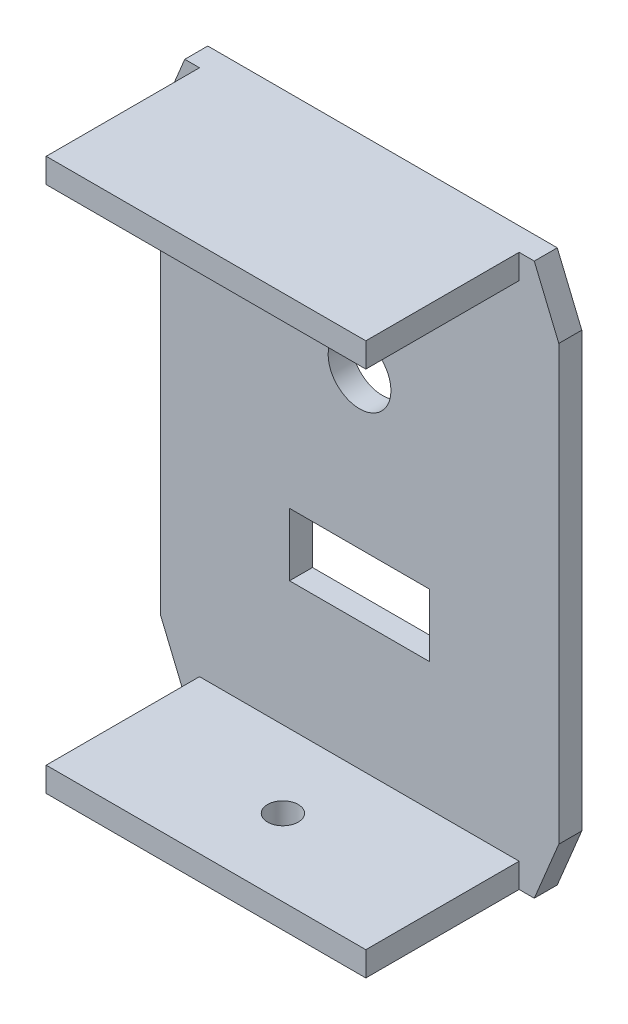
ISO-10303-21;
HEADER;
FILE_DESCRIPTION(('STEP AP214'),'2;1');
FILE_NAME('part.step','',(''),(''),'','','');
FILE_SCHEMA(('AUTOMOTIVE_DESIGN { 1 0 10303 214 1 1 1 1 }'));
ENDSEC;
DATA;
#1=APPLICATION_CONTEXT('core data for automotive mechanical design processes');
#2=APPLICATION_PROTOCOL_DEFINITION('international standard','automotive_design',2000,#1);
#3=PRODUCT_CONTEXT('',#1,'mechanical');
#4=PRODUCT('Part','Part','',(#3));
#5=PRODUCT_RELATED_PRODUCT_CATEGORY('part','',(#4));
#6=PRODUCT_DEFINITION_FORMATION('','',#4);
#7=PRODUCT_DEFINITION_CONTEXT('part definition',#1,'design');
#8=PRODUCT_DEFINITION('design','',#6,#7);
#9=PRODUCT_DEFINITION_SHAPE('','',#8);
#10=(LENGTH_UNIT() NAMED_UNIT(*) SI_UNIT(.MILLI.,.METRE.));
#11=(NAMED_UNIT(*) PLANE_ANGLE_UNIT() SI_UNIT($,.RADIAN.));
#12=(NAMED_UNIT(*) SI_UNIT($,.STERADIAN.) SOLID_ANGLE_UNIT());
#13=UNCERTAINTY_MEASURE_WITH_UNIT(LENGTH_MEASURE(1.E-05),#10,'distance_accuracy_value','');
#14=(GEOMETRIC_REPRESENTATION_CONTEXT(3) GLOBAL_UNCERTAINTY_ASSIGNED_CONTEXT((#13)) GLOBAL_UNIT_ASSIGNED_CONTEXT((#10,
#11,#12)) REPRESENTATION_CONTEXT('',''));
#15=CARTESIAN_POINT('',(0.,0.,0.));
#16=DIRECTION('',(0.,0.,1.));
#17=DIRECTION('',(1.,0.,0.));
#18=AXIS2_PLACEMENT_3D('',#15,#16,#17);
#19=CARTESIAN_POINT('',(0.,0.,4.7625));
#20=DIRECTION('',(0.,0.,1.));
#21=DIRECTION('',(1.,0.,0.));
#22=AXIS2_PLACEMENT_3D('',#19,#20,#21);
#23=PLANE('',#22);
#24=CARTESIAN_POINT('',(-11.0521901818713,10.2491818922136,4.7625));
#25=DIRECTION('',(0.,0.,-1.));
#26=DIRECTION('',(-1.,0.,0.));
#27=AXIS2_PLACEMENT_3D('',#24,#25,#26);
#28=CIRCLE('',#27,6.4999997);
#29=CARTESIAN_POINT('',(-17.5521898818713,10.2491818922136,4.7625));
#30=VERTEX_POINT('',#29);
#31=EDGE_CURVE('E202',#30,#30,#28,.T.);
#32=ORIENTED_EDGE('',*,*,#31,.T.);
#33=EDGE_LOOP('',(#32));
#34=FACE_BOUND('',#33,.T.);
#35=DIRECTION('',(0.,1.,0.));
#36=VECTOR('',#35,1.);
#37=CARTESIAN_POINT('',(-25.5521611818713,-21.3508184077864,4.7625));
#38=LINE('',#37,#36);
#39=CARTESIAN_POINT('',(-25.5521611818713,-34.3508178077864,4.7625));
#40=VERTEX_POINT('',#39);
#41=CARTESIAN_POINT('',(-25.5521611818713,-21.3508184077864,4.7625));
#42=VERTEX_POINT('',#41);
#43=EDGE_CURVE('E174',#40,#42,#38,.T.);
#44=ORIENTED_EDGE('',*,*,#43,.T.);
#45=DIRECTION('',(1.,0.,0.));
#46=VECTOR('',#45,1.);
#47=CARTESIAN_POINT('',(3.44778081812867,-21.3508184077864,4.7625));
#48=LINE('',#47,#46);
#49=CARTESIAN_POINT('',(3.44778081812867,-21.3508184077864,4.7625));
#50=VERTEX_POINT('',#49);
#51=EDGE_CURVE('E183',#42,#50,#48,.T.);
#52=ORIENTED_EDGE('',*,*,#51,.T.);
#53=DIRECTION('',(0.,-1.,0.));
#54=VECTOR('',#53,1.);
#55=CARTESIAN_POINT('',(3.44778081812867,-21.3508184077864,4.7625));
#56=LINE('',#55,#54);
#57=CARTESIAN_POINT('',(3.44778081812867,-34.3508178077864,4.7625));
#58=VERTEX_POINT('',#57);
#59=EDGE_CURVE('E51',#50,#58,#56,.T.);
#60=ORIENTED_EDGE('',*,*,#59,.T.);
#61=DIRECTION('',(-1.,0.,0.));
#62=VECTOR('',#61,1.);
#63=CARTESIAN_POINT('',(3.44778081812867,-34.3508178077864,4.7625));
#64=LINE('',#63,#62);
#65=EDGE_CURVE('E180',#58,#40,#64,.T.);
#66=ORIENTED_EDGE('',*,*,#65,.T.);
#67=EDGE_LOOP('',(#44,#52,#60,#66));
#68=FACE_BOUND('',#67,.T.);
#69=DIRECTION('',(1.,0.,0.));
#70=VECTOR('',#69,1.);
#71=CARTESIAN_POINT('',(0.,-65.9508181077864,4.7625));
#72=LINE('',#71,#70);
#73=CARTESIAN_POINT('',(-47.2471901818713,-65.9508181077864,4.7625));
#74=VERTEX_POINT('',#73);
#75=CARTESIAN_POINT('',(-44.1991901818713,-65.9508181077865,4.7625));
#76=VERTEX_POINT('',#75);
#77=EDGE_CURVE('E273',#74,#76,#72,.T.);
#78=ORIENTED_EDGE('',*,*,#77,.T.);
#79=DIRECTION('',(0.,-1.,0.));
#80=VECTOR('',#79,1.);
#81=CARTESIAN_POINT('',(-44.1991901818713,-60.8709997598715,4.7625));
#82=LINE('',#81,#80);
#83=CARTESIAN_POINT('',(-44.1991901818713,-60.8709997598715,4.7625));
#84=VERTEX_POINT('',#83);
#85=EDGE_CURVE('E225',#84,#76,#82,.T.);
#86=ORIENTED_EDGE('',*,*,#85,.F.);
#87=DIRECTION('',(-1.,0.,0.));
#88=VECTOR('',#87,1.);
#89=CARTESIAN_POINT('',(-44.1991901818713,-60.8709997598715,4.7625));
#90=LINE('',#89,#88);
#91=CARTESIAN_POINT('',(22.0016687501231,-60.8709997598715,4.7625));
#92=VERTEX_POINT('',#91);
#93=EDGE_CURVE('E208',#92,#84,#90,.T.);
#94=ORIENTED_EDGE('',*,*,#93,.F.);
#95=DIRECTION('',(0.,1.,0.));
#96=VECTOR('',#95,1.);
#97=CARTESIAN_POINT('',(22.0016687501231,-60.8709997598715,4.7625));
#98=LINE('',#97,#96);
#99=CARTESIAN_POINT('',(22.0016687501231,-65.9508181077864,4.7625));
#100=VERTEX_POINT('',#99);
#101=EDGE_CURVE('E216',#100,#92,#98,.T.);
#102=ORIENTED_EDGE('',*,*,#101,.F.);
#103=CARTESIAN_POINT('',(25.1428098181287,-65.9508181077864,4.7625));
#104=VERTEX_POINT('',#103);
#105=EDGE_CURVE('E271',#100,#104,#72,.T.);
#106=ORIENTED_EDGE('',*,*,#105,.T.);
#107=DIRECTION('',(0.383447283100766,0.923562765101886,0.));
#108=VECTOR('',#107,1.);
#109=CARTESIAN_POINT('',(44.8016833803675,-18.6008839027281,4.7625));
#110=LINE('',#109,#108);
#111=CARTESIAN_POINT('',(30.2228098181286,-53.7152408759492,4.7625));
#112=VERTEX_POINT('',#111);
#113=EDGE_CURVE('E276',#104,#112,#110,.T.);
#114=ORIENTED_EDGE('',*,*,#113,.T.);
#115=DIRECTION('',(0.,-1.,0.));
#116=VECTOR('',#115,1.);
#117=CARTESIAN_POINT('',(30.2228098181286,0.,4.7625));
#118=LINE('',#117,#116);
#119=CARTESIAN_POINT('',(30.2228098181286,36.1136046603764,4.7625));
#120=VERTEX_POINT('',#119);
#121=EDGE_CURVE('E278',#120,#112,#118,.T.);
#122=ORIENTED_EDGE('',*,*,#121,.F.);
#123=DIRECTION('',(0.383447283100766,-0.923562765101886,0.));
#124=VECTOR('',#123,1.);
#125=CARTESIAN_POINT('',(38.5682815931536,16.0128833140307,4.7625));
#126=LINE('',#125,#124);
#127=CARTESIAN_POINT('',(25.1428098181286,48.3491818922136,4.7625));
#128=VERTEX_POINT('',#127);
#129=EDGE_CURVE('E281',#128,#120,#126,.T.);
#130=ORIENTED_EDGE('',*,*,#129,.F.);
#131=DIRECTION('',(1.,0.,0.));
#132=VECTOR('',#131,1.);
#133=CARTESIAN_POINT('',(0.,48.3491818922136,4.7625));
#134=LINE('',#133,#132);
#135=CARTESIAN_POINT('',(22.0016687501231,48.3491818922136,4.7625));
#136=VERTEX_POINT('',#135);
#137=EDGE_CURVE('E284',#136,#128,#134,.T.);
#138=ORIENTED_EDGE('',*,*,#137,.F.);
#139=DIRECTION('',(0.,1.,0.));
#140=VECTOR('',#139,1.);
#141=CARTESIAN_POINT('',(22.0016687501231,43.2693635442985,4.7625));
#142=LINE('',#141,#140);
#143=CARTESIAN_POINT('',(22.0016687501231,43.2693635442985,4.7625));
#144=VERTEX_POINT('',#143);
#145=EDGE_CURVE('E242',#144,#136,#142,.T.);
#146=ORIENTED_EDGE('',*,*,#145,.F.);
#147=DIRECTION('',(1.,0.,0.));
#148=VECTOR('',#147,1.);
#149=CARTESIAN_POINT('',(-44.1991901818713,43.2693635442985,4.7625));
#150=LINE('',#149,#148);
#151=CARTESIAN_POINT('',(-44.1991901818713,43.2693635442985,4.7625));
#152=VERTEX_POINT('',#151);
#153=EDGE_CURVE('E251',#152,#144,#150,.T.);
#154=ORIENTED_EDGE('',*,*,#153,.F.);
#155=DIRECTION('',(0.,-1.,0.));
#156=VECTOR('',#155,1.);
#157=CARTESIAN_POINT('',(-44.1991901818713,43.2693635442985,4.7625));
#158=LINE('',#157,#156);
#159=CARTESIAN_POINT('',(-44.1991901818713,48.3491818922136,4.7625));
#160=VERTEX_POINT('',#159);
#161=EDGE_CURVE('E237',#160,#152,#158,.T.);
#162=ORIENTED_EDGE('',*,*,#161,.F.);
#163=CARTESIAN_POINT('',(-47.2471901818713,48.3491818922136,4.7625));
#164=VERTEX_POINT('',#163);
#165=EDGE_CURVE('E285',#164,#160,#134,.T.);
#166=ORIENTED_EDGE('',*,*,#165,.F.);
#167=DIRECTION('',(-0.383447283100767,-0.923562765101886,0.));
#168=VECTOR('',#167,1.);
#169=CARTESIAN_POINT('',(-57.4226147059741,23.8408762561133,4.7625));
#170=LINE('',#169,#168);
#171=CARTESIAN_POINT('',(-52.3271901818714,36.1136046603762,4.7625));
#172=VERTEX_POINT('',#171);
#173=EDGE_CURVE('E288',#164,#172,#170,.T.);
#174=ORIENTED_EDGE('',*,*,#173,.T.);
#175=DIRECTION('',(0.,-1.,0.));
#176=VECTOR('',#175,1.);
#177=CARTESIAN_POINT('',(-52.3271901818714,0.,4.7625));
#178=LINE('',#177,#176);
#179=CARTESIAN_POINT('',(-52.3271901818714,-53.7152408759491,4.7625));
#180=VERTEX_POINT('',#179);
#181=EDGE_CURVE('E290',#172,#180,#178,.T.);
#182=ORIENTED_EDGE('',*,*,#181,.T.);
#183=DIRECTION('',(-0.383447283100767,0.923562765101886,0.));
#184=VECTOR('',#183,1.);
#185=CARTESIAN_POINT('',(-63.6560164931879,-26.4288768448106,4.7625));
#186=LINE('',#185,#184);
#187=EDGE_CURVE('E268',#74,#180,#186,.T.);
#188=ORIENTED_EDGE('',*,*,#187,.F.);
#189=EDGE_LOOP('',(#78,#86,#94,#102,#106,#114,#122,#130,#138,#146,#154,#162,#166,#174,#182,#188));
#190=FACE_BOUND('',#189,.T.);
#191=ADVANCED_FACE('F35',(#34,#68,#190),#23,.T.);
#192=CARTESIAN_POINT('',(-63.6560164931879,-26.4288768448106,4.7625));
#193=DIRECTION('',(-0.923562765101886,-0.383447283100766,0.));
#194=DIRECTION('',(0.383447283100767,-0.923562765101886,0.));
#195=AXIS2_PLACEMENT_3D('',#192,#193,#194);
#196=PLANE('',#195);
#197=DIRECTION('',(-0.383447283100767,0.923562765101886,0.));
#198=VECTOR('',#197,1.);
#199=CARTESIAN_POINT('',(-63.6560164931879,-26.4288768448106,0.));
#200=LINE('',#199,#198);
#201=CARTESIAN_POINT('',(-47.2471901818713,-65.9508181077864,0.));
#202=VERTEX_POINT('',#201);
#203=CARTESIAN_POINT('',(-52.3271901818714,-53.7152408759491,0.));
#204=VERTEX_POINT('',#203);
#205=EDGE_CURVE('E267',#202,#204,#200,.T.);
#206=ORIENTED_EDGE('',*,*,#205,.F.);
#207=DIRECTION('',(0.,0.,-1.));
#208=VECTOR('',#207,1.);
#209=CARTESIAN_POINT('',(-47.2471901818713,-65.9508181077864,4.7625));
#210=LINE('',#209,#208);
#211=EDGE_CURVE('E11',#74,#202,#210,.T.);
#212=ORIENTED_EDGE('',*,*,#211,.F.);
#213=ORIENTED_EDGE('',*,*,#187,.T.);
#214=DIRECTION('',(0.,0.,-1.));
#215=VECTOR('',#214,1.);
#216=CARTESIAN_POINT('',(-52.3271901818714,-53.7152408759491,4.7625));
#217=LINE('',#216,#215);
#218=EDGE_CURVE('E292',#180,#204,#217,.T.);
#219=ORIENTED_EDGE('',*,*,#218,.T.);
#220=EDGE_LOOP('',(#206,#212,#213,#219));
#221=FACE_BOUND('',#220,.T.);
#222=ADVANCED_FACE('F37',(#221),#196,.T.);
#223=CARTESIAN_POINT('',(0.,-65.9508181077864,4.7625));
#224=DIRECTION('',(0.,1.,0.));
#225=DIRECTION('',(0.,0.,1.));
#226=AXIS2_PLACEMENT_3D('',#223,#224,#225);
#227=PLANE('',#226);
#228=CARTESIAN_POINT('',(-11.0521901818713,-65.9508181077864,20.6375));
#229=DIRECTION('',(0.,-1.,0.));
#230=DIRECTION('',(0.,0.,-1.));
#231=AXIS2_PLACEMENT_3D('',#228,#229,#230);
#232=CIRCLE('',#231,3.175);
#233=CARTESIAN_POINT('',(-11.0521901818713,-65.9508181077864,17.4625));
#234=VERTEX_POINT('',#233);
#235=EDGE_CURVE('E417',#234,#234,#232,.T.);
#236=ORIENTED_EDGE('',*,*,#235,.F.);
#237=EDGE_LOOP('',(#236));
#238=FACE_BOUND('',#237,.T.);
#239=DIRECTION('',(1.,0.,0.));
#240=VECTOR('',#239,1.);
#241=CARTESIAN_POINT('',(0.,-65.9508181077864,0.));
#242=LINE('',#241,#240);
#243=CARTESIAN_POINT('',(25.1428098181287,-65.9508181077864,0.));
#244=VERTEX_POINT('',#243);
#245=EDGE_CURVE('E295',#202,#244,#242,.T.);
#246=ORIENTED_EDGE('',*,*,#245,.T.);
#247=DIRECTION('',(0.,0.,-1.));
#248=VECTOR('',#247,1.);
#249=CARTESIAN_POINT('',(25.1428098181287,-65.9508181077864,4.7625));
#250=LINE('',#249,#248);
#251=EDGE_CURVE('E44',#104,#244,#250,.T.);
#252=ORIENTED_EDGE('',*,*,#251,.F.);
#253=ORIENTED_EDGE('',*,*,#105,.F.);
#254=DIRECTION('',(0.,0.,-1.));
#255=VECTOR('',#254,1.);
#256=CARTESIAN_POINT('',(22.0016687501231,-65.9508181077865,36.5125));
#257=LINE('',#256,#255);
#258=CARTESIAN_POINT('',(22.0016687501231,-65.9508181077865,36.5125));
#259=VERTEX_POINT('',#258);
#260=EDGE_CURVE('E230',#259,#100,#257,.T.);
#261=ORIENTED_EDGE('',*,*,#260,.F.);
#262=DIRECTION('',(1.,0.,0.));
#263=VECTOR('',#262,1.);
#264=CARTESIAN_POINT('',(-44.1991901818713,-65.9508181077865,36.5125));
#265=LINE('',#264,#263);
#266=CARTESIAN_POINT('',(-44.1991901818713,-65.9508181077865,36.5125));
#267=VERTEX_POINT('',#266);
#268=EDGE_CURVE('E218',#267,#259,#265,.T.);
#269=ORIENTED_EDGE('',*,*,#268,.F.);
#270=DIRECTION('',(0.,0.,-1.));
#271=VECTOR('',#270,1.);
#272=CARTESIAN_POINT('',(-44.1991901818713,-65.9508181077865,36.5125));
#273=LINE('',#272,#271);
#274=EDGE_CURVE('E232',#267,#76,#273,.T.);
#275=ORIENTED_EDGE('',*,*,#274,.T.);
#276=ORIENTED_EDGE('',*,*,#77,.F.);
#277=ORIENTED_EDGE('',*,*,#211,.T.);
#278=EDGE_LOOP('',(#246,#252,#253,#261,#269,#275,#276,#277));
#279=FACE_BOUND('',#278,.T.);
#280=ADVANCED_FACE('F387',(#238,#279),#227,.F.);
#281=CARTESIAN_POINT('',(44.8016833803675,-18.6008839027281,4.7625));
#282=DIRECTION('',(-0.923562765101886,0.383447283100766,0.));
#283=DIRECTION('',(-0.383447283100766,-0.923562765101886,0.));
#284=AXIS2_PLACEMENT_3D('',#281,#282,#283);
#285=PLANE('',#284);
#286=DIRECTION('',(0.383447283100766,0.923562765101886,0.));
#287=VECTOR('',#286,1.);
#288=CARTESIAN_POINT('',(44.8016833803675,-18.6008839027281,0.));
#289=LINE('',#288,#287);
#290=CARTESIAN_POINT('',(30.2228098181286,-53.7152408759492,0.));
#291=VERTEX_POINT('',#290);
#292=EDGE_CURVE('E297',#244,#291,#289,.T.);
#293=ORIENTED_EDGE('',*,*,#292,.T.);
#294=DIRECTION('',(0.,0.,-1.));
#295=VECTOR('',#294,1.);
#296=CARTESIAN_POINT('',(30.2228098181286,-53.7152408759492,4.7625));
#297=LINE('',#296,#295);
#298=EDGE_CURVE('E323',#112,#291,#297,.T.);
#299=ORIENTED_EDGE('',*,*,#298,.F.);
#300=ORIENTED_EDGE('',*,*,#113,.F.);
#301=ORIENTED_EDGE('',*,*,#251,.T.);
#302=EDGE_LOOP('',(#293,#299,#300,#301));
#303=FACE_BOUND('',#302,.T.);
#304=ADVANCED_FACE('F330',(#303),#285,.F.);
#305=CARTESIAN_POINT('',(30.2228098181286,0.,4.7625));
#306=DIRECTION('',(1.,0.,0.));
#307=DIRECTION('',(0.,1.,0.));
#308=AXIS2_PLACEMENT_3D('',#305,#306,#307);
#309=PLANE('',#308);
#310=DIRECTION('',(0.,-1.,0.));
#311=VECTOR('',#310,1.);
#312=CARTESIAN_POINT('',(30.2228098181286,0.,0.));
#313=LINE('',#312,#311);
#314=CARTESIAN_POINT('',(30.2228098181286,36.1136046603764,0.));
#315=VERTEX_POINT('',#314);
#316=EDGE_CURVE('E300',#315,#291,#313,.T.);
#317=ORIENTED_EDGE('',*,*,#316,.F.);
#318=DIRECTION('',(0.,0.,-1.));
#319=VECTOR('',#318,1.);
#320=CARTESIAN_POINT('',(30.2228098181286,36.1136046603764,4.7625));
#321=LINE('',#320,#319);
#322=EDGE_CURVE('E321',#120,#315,#321,.T.);
#323=ORIENTED_EDGE('',*,*,#322,.F.);
#324=ORIENTED_EDGE('',*,*,#121,.T.);
#325=ORIENTED_EDGE('',*,*,#298,.T.);
#326=EDGE_LOOP('',(#317,#323,#324,#325));
#327=FACE_BOUND('',#326,.T.);
#328=ADVANCED_FACE('F341',(#327),#309,.T.);
#329=CARTESIAN_POINT('',(38.5682815931536,16.0128833140307,4.7625));
#330=DIRECTION('',(0.923562765101886,0.383447283100766,0.));
#331=DIRECTION('',(-0.383447283100766,0.923562765101886,0.));
#332=AXIS2_PLACEMENT_3D('',#329,#330,#331);
#333=PLANE('',#332);
#334=DIRECTION('',(0.383447283100766,-0.923562765101886,0.));
#335=VECTOR('',#334,1.);
#336=CARTESIAN_POINT('',(38.5682815931536,16.0128833140307,0.));
#337=LINE('',#336,#335);
#338=CARTESIAN_POINT('',(25.1428098181286,48.3491818922136,0.));
#339=VERTEX_POINT('',#338);
#340=EDGE_CURVE('E303',#339,#315,#337,.T.);
#341=ORIENTED_EDGE('',*,*,#340,.F.);
#342=DIRECTION('',(0.,0.,-1.));
#343=VECTOR('',#342,1.);
#344=CARTESIAN_POINT('',(25.1428098181286,48.3491818922136,4.7625));
#345=LINE('',#344,#343);
#346=EDGE_CURVE('E319',#128,#339,#345,.T.);
#347=ORIENTED_EDGE('',*,*,#346,.F.);
#348=ORIENTED_EDGE('',*,*,#129,.T.);
#349=ORIENTED_EDGE('',*,*,#322,.T.);
#350=EDGE_LOOP('',(#341,#347,#348,#349));
#351=FACE_BOUND('',#350,.T.);
#352=ADVANCED_FACE('F346',(#351),#333,.T.);
#353=CARTESIAN_POINT('',(0.,48.3491818922136,4.7625));
#354=DIRECTION('',(0.,1.,0.));
#355=DIRECTION('',(0.,0.,1.));
#356=AXIS2_PLACEMENT_3D('',#353,#354,#355);
#357=PLANE('',#356);
#358=DIRECTION('',(1.,0.,0.));
#359=VECTOR('',#358,1.);
#360=CARTESIAN_POINT('',(0.,48.3491818922136,0.));
#361=LINE('',#360,#359);
#362=CARTESIAN_POINT('',(-47.2471901818713,48.3491818922136,0.));
#363=VERTEX_POINT('',#362);
#364=EDGE_CURVE('E306',#363,#339,#361,.T.);
#365=ORIENTED_EDGE('',*,*,#364,.F.);
#366=DIRECTION('',(0.,0.,-1.));
#367=VECTOR('',#366,1.);
#368=CARTESIAN_POINT('',(-47.2471901818713,48.3491818922136,4.7625));
#369=LINE('',#368,#367);
#370=EDGE_CURVE('E317',#164,#363,#369,.T.);
#371=ORIENTED_EDGE('',*,*,#370,.F.);
#372=ORIENTED_EDGE('',*,*,#165,.T.);
#373=DIRECTION('',(0.,0.,-1.));
#374=VECTOR('',#373,1.);
#375=CARTESIAN_POINT('',(-44.1991901818713,48.3491818922136,36.5125));
#376=LINE('',#375,#374);
#377=CARTESIAN_POINT('',(-44.1991901818713,48.3491818922136,36.5125));
#378=VERTEX_POINT('',#377);
#379=EDGE_CURVE('E248',#378,#160,#376,.T.);
#380=ORIENTED_EDGE('',*,*,#379,.F.);
#381=DIRECTION('',(-1.,0.,0.));
#382=VECTOR('',#381,1.);
#383=CARTESIAN_POINT('',(-44.1991901818713,48.3491818922136,36.5125));
#384=LINE('',#383,#382);
#385=CARTESIAN_POINT('',(22.0016687501231,48.3491818922136,36.5125));
#386=VERTEX_POINT('',#385);
#387=EDGE_CURVE('E246',#386,#378,#384,.T.);
#388=ORIENTED_EDGE('',*,*,#387,.F.);
#389=DIRECTION('',(0.,0.,-1.));
#390=VECTOR('',#389,1.);
#391=CARTESIAN_POINT('',(22.0016687501231,48.3491818922136,36.5125));
#392=LINE('',#391,#390);
#393=EDGE_CURVE('E258',#386,#136,#392,.T.);
#394=ORIENTED_EDGE('',*,*,#393,.T.);
#395=ORIENTED_EDGE('',*,*,#137,.T.);
#396=ORIENTED_EDGE('',*,*,#346,.T.);
#397=EDGE_LOOP('',(#365,#371,#372,#380,#388,#394,#395,#396));
#398=FACE_BOUND('',#397,.T.);
#399=ADVANCED_FACE('F349',(#398),#357,.T.);
#400=CARTESIAN_POINT('',(-57.4226147059741,23.8408762561133,4.7625));
#401=DIRECTION('',(0.923562765101886,-0.383447283100766,0.));
#402=DIRECTION('',(0.383447283100767,0.923562765101886,0.));
#403=AXIS2_PLACEMENT_3D('',#400,#401,#402);
#404=PLANE('',#403);
#405=DIRECTION('',(-0.383447283100767,-0.923562765101886,0.));
#406=VECTOR('',#405,1.);
#407=CARTESIAN_POINT('',(-57.4226147059741,23.8408762561133,0.));
#408=LINE('',#407,#406);
#409=CARTESIAN_POINT('',(-52.3271901818714,36.1136046603762,0.));
#410=VERTEX_POINT('',#409);
#411=EDGE_CURVE('E309',#363,#410,#408,.T.);
#412=ORIENTED_EDGE('',*,*,#411,.T.);
#413=DIRECTION('',(0.,0.,-1.));
#414=VECTOR('',#413,1.);
#415=CARTESIAN_POINT('',(-52.3271901818714,36.1136046603762,4.7625));
#416=LINE('',#415,#414);
#417=EDGE_CURVE('E314',#172,#410,#416,.T.);
#418=ORIENTED_EDGE('',*,*,#417,.F.);
#419=ORIENTED_EDGE('',*,*,#173,.F.);
#420=ORIENTED_EDGE('',*,*,#370,.T.);
#421=EDGE_LOOP('',(#412,#418,#419,#420));
#422=FACE_BOUND('',#421,.T.);
#423=ADVANCED_FACE('F398',(#422),#404,.F.);
#424=CARTESIAN_POINT('',(-52.3271901818714,0.,4.7625));
#425=DIRECTION('',(1.,0.,0.));
#426=DIRECTION('',(0.,1.,0.));
#427=AXIS2_PLACEMENT_3D('',#424,#425,#426);
#428=PLANE('',#427);
#429=DIRECTION('',(0.,-1.,0.));
#430=VECTOR('',#429,1.);
#431=CARTESIAN_POINT('',(-52.3271901818714,0.,0.));
#432=LINE('',#431,#430);
#433=EDGE_CURVE('E272',#410,#204,#432,.T.);
#434=ORIENTED_EDGE('',*,*,#433,.T.);
#435=ORIENTED_EDGE('',*,*,#218,.F.);
#436=ORIENTED_EDGE('',*,*,#181,.F.);
#437=ORIENTED_EDGE('',*,*,#417,.T.);
#438=EDGE_LOOP('',(#434,#435,#436,#437));
#439=FACE_BOUND('',#438,.T.);
#440=ADVANCED_FACE('F394',(#439),#428,.F.);
#441=CARTESIAN_POINT('',(0.,0.,0.));
#442=DIRECTION('',(0.,0.,1.));
#443=DIRECTION('',(1.,0.,0.));
#444=AXIS2_PLACEMENT_3D('',#441,#442,#443);
#445=PLANE('',#444);
#446=CARTESIAN_POINT('',(-11.0521901818713,10.2491818922136,0.));
#447=DIRECTION('',(0.,0.,-1.));
#448=DIRECTION('',(-1.,0.,0.));
#449=AXIS2_PLACEMENT_3D('',#446,#447,#448);
#450=CIRCLE('',#449,6.4999997);
#451=CARTESIAN_POINT('',(-17.5521898818713,10.2491818922136,0.));
#452=VERTEX_POINT('',#451);
#453=EDGE_CURVE('E195',#452,#452,#450,.T.);
#454=ORIENTED_EDGE('',*,*,#453,.F.);
#455=EDGE_LOOP('',(#454));
#456=FACE_BOUND('',#455,.T.);
#457=DIRECTION('',(1.,0.,0.));
#458=VECTOR('',#457,1.);
#459=CARTESIAN_POINT('',(3.44778081812867,-21.3508184077864,0.));
#460=LINE('',#459,#458);
#461=CARTESIAN_POINT('',(-25.5521611818713,-21.3508184077864,0.));
#462=VERTEX_POINT('',#461);
#463=CARTESIAN_POINT('',(3.44778081812867,-21.3508184077864,0.));
#464=VERTEX_POINT('',#463);
#465=EDGE_CURVE('E201',#462,#464,#460,.T.);
#466=ORIENTED_EDGE('',*,*,#465,.F.);
#467=DIRECTION('',(0.,1.,0.));
#468=VECTOR('',#467,1.);
#469=CARTESIAN_POINT('',(-25.5521611818713,-21.3508184077864,0.));
#470=LINE('',#469,#468);
#471=CARTESIAN_POINT('',(-25.5521611818713,-34.3508178077864,0.));
#472=VERTEX_POINT('',#471);
#473=EDGE_CURVE('E59',#472,#462,#470,.T.);
#474=ORIENTED_EDGE('',*,*,#473,.F.);
#475=DIRECTION('',(-1.,0.,0.));
#476=VECTOR('',#475,1.);
#477=CARTESIAN_POINT('',(3.44778081812867,-34.3508178077864,0.));
#478=LINE('',#477,#476);
#479=CARTESIAN_POINT('',(3.44778081812867,-34.3508178077864,0.));
#480=VERTEX_POINT('',#479);
#481=EDGE_CURVE('E189',#480,#472,#478,.T.);
#482=ORIENTED_EDGE('',*,*,#481,.F.);
#483=DIRECTION('',(0.,-1.,0.));
#484=VECTOR('',#483,1.);
#485=CARTESIAN_POINT('',(3.44778081812867,-21.3508184077864,0.));
#486=LINE('',#485,#484);
#487=EDGE_CURVE('E192',#464,#480,#486,.T.);
#488=ORIENTED_EDGE('',*,*,#487,.F.);
#489=EDGE_LOOP('',(#466,#474,#482,#488));
#490=FACE_BOUND('',#489,.T.);
#491=ORIENTED_EDGE('',*,*,#205,.T.);
#492=ORIENTED_EDGE('',*,*,#433,.F.);
#493=ORIENTED_EDGE('',*,*,#411,.F.);
#494=ORIENTED_EDGE('',*,*,#364,.T.);
#495=ORIENTED_EDGE('',*,*,#340,.T.);
#496=ORIENTED_EDGE('',*,*,#316,.T.);
#497=ORIENTED_EDGE('',*,*,#292,.F.);
#498=ORIENTED_EDGE('',*,*,#245,.F.);
#499=EDGE_LOOP('',(#491,#492,#493,#494,#495,#496,#497,#498));
#500=FACE_BOUND('',#499,.T.);
#501=ADVANCED_FACE('F336',(#456,#490,#500),#445,.F.);
#502=CARTESIAN_POINT('',(-44.1991901818713,43.2693635442985,36.5125));
#503=DIRECTION('',(1.,0.,0.));
#504=DIRECTION('',(0.,0.,-1.));
#505=AXIS2_PLACEMENT_3D('',#502,#503,#504);
#506=PLANE('',#505);
#507=ORIENTED_EDGE('',*,*,#161,.T.);
#508=DIRECTION('',(0.,0.,-1.));
#509=VECTOR('',#508,1.);
#510=CARTESIAN_POINT('',(-44.1991901818713,43.2693635442985,36.5125));
#511=LINE('',#510,#509);
#512=CARTESIAN_POINT('',(-44.1991901818713,43.2693635442985,36.5125));
#513=VERTEX_POINT('',#512);
#514=EDGE_CURVE('E264',#513,#152,#511,.T.);
#515=ORIENTED_EDGE('',*,*,#514,.F.);
#516=DIRECTION('',(0.,-1.,0.));
#517=VECTOR('',#516,1.);
#518=CARTESIAN_POINT('',(-44.1991901818713,43.2693635442985,36.5125));
#519=LINE('',#518,#517);
#520=EDGE_CURVE('E238',#378,#513,#519,.T.);
#521=ORIENTED_EDGE('',*,*,#520,.F.);
#522=ORIENTED_EDGE('',*,*,#379,.T.);
#523=EDGE_LOOP('',(#507,#515,#521,#522));
#524=FACE_BOUND('',#523,.T.);
#525=ADVANCED_FACE('F364',(#524),#506,.F.);
#526=CARTESIAN_POINT('',(-44.1991901818713,43.2693635442985,36.5125));
#527=DIRECTION('',(0.,1.,0.));
#528=DIRECTION('',(0.,0.,1.));
#529=AXIS2_PLACEMENT_3D('',#526,#527,#528);
#530=PLANE('',#529);
#531=ORIENTED_EDGE('',*,*,#153,.T.);
#532=DIRECTION('',(0.,0.,-1.));
#533=VECTOR('',#532,1.);
#534=CARTESIAN_POINT('',(22.0016687501231,43.2693635442985,36.5125));
#535=LINE('',#534,#533);
#536=CARTESIAN_POINT('',(22.0016687501231,43.2693635442985,36.5125));
#537=VERTEX_POINT('',#536);
#538=EDGE_CURVE('E261',#537,#144,#535,.T.);
#539=ORIENTED_EDGE('',*,*,#538,.F.);
#540=DIRECTION('',(1.,0.,0.));
#541=VECTOR('',#540,1.);
#542=CARTESIAN_POINT('',(-44.1991901818713,43.2693635442985,36.5125));
#543=LINE('',#542,#541);
#544=EDGE_CURVE('E241',#513,#537,#543,.T.);
#545=ORIENTED_EDGE('',*,*,#544,.F.);
#546=ORIENTED_EDGE('',*,*,#514,.T.);
#547=EDGE_LOOP('',(#531,#539,#545,#546));
#548=FACE_BOUND('',#547,.T.);
#549=ADVANCED_FACE('F357',(#548),#530,.F.);
#550=CARTESIAN_POINT('',(22.0016687501231,43.2693635442985,36.5125));
#551=DIRECTION('',(-1.,0.,0.));
#552=DIRECTION('',(0.,0.,1.));
#553=AXIS2_PLACEMENT_3D('',#550,#551,#552);
#554=PLANE('',#553);
#555=ORIENTED_EDGE('',*,*,#145,.T.);
#556=ORIENTED_EDGE('',*,*,#393,.F.);
#557=DIRECTION('',(0.,1.,0.));
#558=VECTOR('',#557,1.);
#559=CARTESIAN_POINT('',(22.0016687501231,43.2693635442985,36.5125));
#560=LINE('',#559,#558);
#561=EDGE_CURVE('E244',#537,#386,#560,.T.);
#562=ORIENTED_EDGE('',*,*,#561,.F.);
#563=ORIENTED_EDGE('',*,*,#538,.T.);
#564=EDGE_LOOP('',(#555,#556,#562,#563));
#565=FACE_BOUND('',#564,.T.);
#566=ADVANCED_FACE('F353',(#565),#554,.F.);
#567=CARTESIAN_POINT('',(0.,0.,36.5125));
#568=DIRECTION('',(0.,0.,-1.));
#569=DIRECTION('',(-1.,0.,0.));
#570=AXIS2_PLACEMENT_3D('',#567,#568,#569);
#571=PLANE('',#570);
#572=ORIENTED_EDGE('',*,*,#520,.T.);
#573=ORIENTED_EDGE('',*,*,#544,.T.);
#574=ORIENTED_EDGE('',*,*,#561,.T.);
#575=ORIENTED_EDGE('',*,*,#387,.T.);
#576=EDGE_LOOP('',(#572,#573,#574,#575));
#577=FACE_BOUND('',#576,.T.);
#578=ADVANCED_FACE('F366',(#577),#571,.F.);
#579=CARTESIAN_POINT('',(-44.1991901818713,-60.8709997598715,36.5125));
#580=DIRECTION('',(0.,-1.,0.));
#581=DIRECTION('',(0.,0.,-1.));
#582=AXIS2_PLACEMENT_3D('',#579,#580,#581);
#583=PLANE('',#582);
#584=CARTESIAN_POINT('',(-11.0521901818713,-60.8709997598715,20.6375));
#585=DIRECTION('',(0.,-1.,0.));
#586=DIRECTION('',(0.,0.,-1.));
#587=AXIS2_PLACEMENT_3D('',#584,#585,#586);
#588=CIRCLE('',#587,3.175);
#589=CARTESIAN_POINT('',(-11.0521901818713,-60.8709997598715,17.4625));
#590=VERTEX_POINT('',#589);
#591=EDGE_CURVE('E39',#590,#590,#588,.T.);
#592=ORIENTED_EDGE('',*,*,#591,.T.);
#593=EDGE_LOOP('',(#592));
#594=FACE_BOUND('',#593,.T.);
#595=ORIENTED_EDGE('',*,*,#93,.T.);
#596=DIRECTION('',(0.,0.,-1.));
#597=VECTOR('',#596,1.);
#598=CARTESIAN_POINT('',(-44.1991901818713,-60.8709997598715,36.5125));
#599=LINE('',#598,#597);
#600=CARTESIAN_POINT('',(-44.1991901818713,-60.8709997598715,36.5125));
#601=VERTEX_POINT('',#600);
#602=EDGE_CURVE('E235',#601,#84,#599,.T.);
#603=ORIENTED_EDGE('',*,*,#602,.F.);
#604=DIRECTION('',(-1.,0.,0.));
#605=VECTOR('',#604,1.);
#606=CARTESIAN_POINT('',(-44.1991901818713,-60.8709997598715,36.5125));
#607=LINE('',#606,#605);
#608=CARTESIAN_POINT('',(22.0016687501231,-60.8709997598715,36.5125));
#609=VERTEX_POINT('',#608);
#610=EDGE_CURVE('E212',#609,#601,#607,.T.);
#611=ORIENTED_EDGE('',*,*,#610,.F.);
#612=DIRECTION('',(0.,0.,-1.));
#613=VECTOR('',#612,1.);
#614=CARTESIAN_POINT('',(22.0016687501231,-60.8709997598715,36.5125));
#615=LINE('',#614,#613);
#616=EDGE_CURVE('E222',#609,#92,#615,.T.);
#617=ORIENTED_EDGE('',*,*,#616,.T.);
#618=EDGE_LOOP('',(#595,#603,#611,#617));
#619=FACE_BOUND('',#618,.T.);
#620=ADVANCED_FACE('F368',(#594,#619),#583,.F.);
#621=CARTESIAN_POINT('',(-44.1991901818713,-60.8709997598715,36.5125));
#622=DIRECTION('',(1.,0.,0.));
#623=DIRECTION('',(0.,0.,-1.));
#624=AXIS2_PLACEMENT_3D('',#621,#622,#623);
#625=PLANE('',#624);
#626=ORIENTED_EDGE('',*,*,#85,.T.);
#627=ORIENTED_EDGE('',*,*,#274,.F.);
#628=DIRECTION('',(0.,-1.,0.));
#629=VECTOR('',#628,1.);
#630=CARTESIAN_POINT('',(-44.1991901818713,-60.8709997598715,36.5125));
#631=LINE('',#630,#629);
#632=EDGE_CURVE('E215',#601,#267,#631,.T.);
#633=ORIENTED_EDGE('',*,*,#632,.F.);
#634=ORIENTED_EDGE('',*,*,#602,.T.);
#635=EDGE_LOOP('',(#626,#627,#633,#634));
#636=FACE_BOUND('',#635,.T.);
#637=ADVANCED_FACE('F375',(#636),#625,.F.);
#638=CARTESIAN_POINT('',(22.0016687501231,-60.8709997598715,36.5125));
#639=DIRECTION('',(-1.,0.,0.));
#640=DIRECTION('',(0.,0.,1.));
#641=AXIS2_PLACEMENT_3D('',#638,#639,#640);
#642=PLANE('',#641);
#643=ORIENTED_EDGE('',*,*,#101,.T.);
#644=ORIENTED_EDGE('',*,*,#616,.F.);
#645=DIRECTION('',(0.,1.,0.));
#646=VECTOR('',#645,1.);
#647=CARTESIAN_POINT('',(22.0016687501231,-60.8709997598715,36.5125));
#648=LINE('',#647,#646);
#649=EDGE_CURVE('E220',#259,#609,#648,.T.);
#650=ORIENTED_EDGE('',*,*,#649,.F.);
#651=ORIENTED_EDGE('',*,*,#260,.T.);
#652=EDGE_LOOP('',(#643,#644,#650,#651));
#653=FACE_BOUND('',#652,.T.);
#654=ADVANCED_FACE('F440',(#653),#642,.F.);
#655=CARTESIAN_POINT('',(0.,0.,36.5125));
#656=DIRECTION('',(0.,0.,-1.));
#657=DIRECTION('',(-1.,0.,0.));
#658=AXIS2_PLACEMENT_3D('',#655,#656,#657);
#659=PLANE('',#658);
#660=ORIENTED_EDGE('',*,*,#610,.T.);
#661=ORIENTED_EDGE('',*,*,#632,.T.);
#662=ORIENTED_EDGE('',*,*,#268,.T.);
#663=ORIENTED_EDGE('',*,*,#649,.T.);
#664=EDGE_LOOP('',(#660,#661,#662,#663));
#665=FACE_BOUND('',#664,.T.);
#666=ADVANCED_FACE('F435',(#665),#659,.F.);
#667=CARTESIAN_POINT('',(-25.5521611818713,-21.3508184077864,4.7625));
#668=DIRECTION('',(-1.,0.,0.));
#669=DIRECTION('',(0.,-1.,0.));
#670=AXIS2_PLACEMENT_3D('',#667,#668,#669);
#671=PLANE('',#670);
#672=ORIENTED_EDGE('',*,*,#473,.T.);
#673=DIRECTION('',(0.,0.,-1.));
#674=VECTOR('',#673,1.);
#675=CARTESIAN_POINT('',(-25.5521611818713,-21.3508184077864,4.7625));
#676=LINE('',#675,#674);
#677=EDGE_CURVE('E170',#42,#462,#676,.T.);
#678=ORIENTED_EDGE('',*,*,#677,.F.);
#679=ORIENTED_EDGE('',*,*,#43,.F.);
#680=DIRECTION('',(0.,0.,-1.));
#681=VECTOR('',#680,1.);
#682=CARTESIAN_POINT('',(-25.5521611818713,-34.3508178077864,4.7625));
#683=LINE('',#682,#681);
#684=EDGE_CURVE('E206',#40,#472,#683,.T.);
#685=ORIENTED_EDGE('',*,*,#684,.T.);
#686=EDGE_LOOP('',(#672,#678,#679,#685));
#687=FACE_BOUND('',#686,.T.);
#688=ADVANCED_FACE('F172',(#687),#671,.F.);
#689=CARTESIAN_POINT('',(3.44778081812867,-34.3508178077864,4.7625));
#690=DIRECTION('',(0.,-1.,0.));
#691=DIRECTION('',(0.,0.,-1.));
#692=AXIS2_PLACEMENT_3D('',#689,#690,#691);
#693=PLANE('',#692);
#694=ORIENTED_EDGE('',*,*,#481,.T.);
#695=ORIENTED_EDGE('',*,*,#684,.F.);
#696=ORIENTED_EDGE('',*,*,#65,.F.);
#697=DIRECTION('',(0.,0.,-1.));
#698=VECTOR('',#697,1.);
#699=CARTESIAN_POINT('',(3.44778081812867,-34.3508178077864,4.7625));
#700=LINE('',#699,#698);
#701=EDGE_CURVE('E209',#58,#480,#700,.T.);
#702=ORIENTED_EDGE('',*,*,#701,.T.);
#703=EDGE_LOOP('',(#694,#695,#696,#702));
#704=FACE_BOUND('',#703,.T.);
#705=ADVANCED_FACE('F452',(#704),#693,.F.);
#706=CARTESIAN_POINT('',(3.44778081812867,-21.3508184077864,4.7625));
#707=DIRECTION('',(1.,0.,0.));
#708=DIRECTION('',(0.,1.,0.));
#709=AXIS2_PLACEMENT_3D('',#706,#707,#708);
#710=PLANE('',#709);
#711=ORIENTED_EDGE('',*,*,#487,.T.);
#712=ORIENTED_EDGE('',*,*,#701,.F.);
#713=ORIENTED_EDGE('',*,*,#59,.F.);
#714=DIRECTION('',(0.,0.,-1.));
#715=VECTOR('',#714,1.);
#716=CARTESIAN_POINT('',(3.44778081812867,-21.3508184077864,4.7625));
#717=LINE('',#716,#715);
#718=EDGE_CURVE('E179',#50,#464,#717,.T.);
#719=ORIENTED_EDGE('',*,*,#718,.T.);
#720=EDGE_LOOP('',(#711,#712,#713,#719));
#721=FACE_BOUND('',#720,.T.);
#722=ADVANCED_FACE('F456',(#721),#710,.F.);
#723=CARTESIAN_POINT('',(3.44778081812867,-21.3508184077864,4.7625));
#724=DIRECTION('',(0.,1.,0.));
#725=DIRECTION('',(0.,0.,1.));
#726=AXIS2_PLACEMENT_3D('',#723,#724,#725);
#727=PLANE('',#726);
#728=ORIENTED_EDGE('',*,*,#465,.T.);
#729=ORIENTED_EDGE('',*,*,#718,.F.);
#730=ORIENTED_EDGE('',*,*,#51,.F.);
#731=ORIENTED_EDGE('',*,*,#677,.T.);
#732=EDGE_LOOP('',(#728,#729,#730,#731));
#733=FACE_BOUND('',#732,.T.);
#734=ADVANCED_FACE('F184',(#733),#727,.F.);
#735=CARTESIAN_POINT('',(-11.0521901818713,10.2491818922136,4.7625));
#736=DIRECTION('',(0.,0.,-1.));
#737=DIRECTION('',(-1.,0.,0.));
#738=AXIS2_PLACEMENT_3D('',#735,#736,#737);
#739=CYLINDRICAL_SURFACE('',#738,6.4999997);
#740=ORIENTED_EDGE('',*,*,#31,.F.);
#741=EDGE_LOOP('',(#740));
#742=FACE_BOUND('',#741,.T.);
#743=ORIENTED_EDGE('',*,*,#453,.T.);
#744=EDGE_LOOP('',(#743));
#745=FACE_BOUND('',#744,.T.);
#746=ADVANCED_FACE('F455',(#742,#745),#739,.F.);
#747=CARTESIAN_POINT('',(-11.0521901818713,-58.6483181077864,20.6375));
#748=DIRECTION('',(0.,-1.,0.));
#749=DIRECTION('',(0.,0.,-1.));
#750=AXIS2_PLACEMENT_3D('',#747,#748,#749);
#751=CYLINDRICAL_SURFACE('',#750,3.175);
#752=ORIENTED_EDGE('',*,*,#235,.T.);
#753=EDGE_LOOP('',(#752));
#754=FACE_BOUND('',#753,.T.);
#755=ORIENTED_EDGE('',*,*,#591,.F.);
#756=EDGE_LOOP('',(#755));
#757=FACE_BOUND('',#756,.T.);
#758=ADVANCED_FACE('F464',(#754,#757),#751,.F.);
#759=CLOSED_SHELL('',(#191,#222,#280,#304,#328,#352,#399,#423,#440,#501,#525,#549,#566,#578,
#620,#637,#654,#666,#688,#705,#722,#734,#746,#758));
#760=MANIFOLD_SOLID_BREP('B2',#759);
#761=ADVANCED_BREP_SHAPE_REPRESENTATION('',(#18,#760),#14);
#762=SHAPE_DEFINITION_REPRESENTATION(#9,#761);
ENDSEC;
END-ISO-10303-21;
